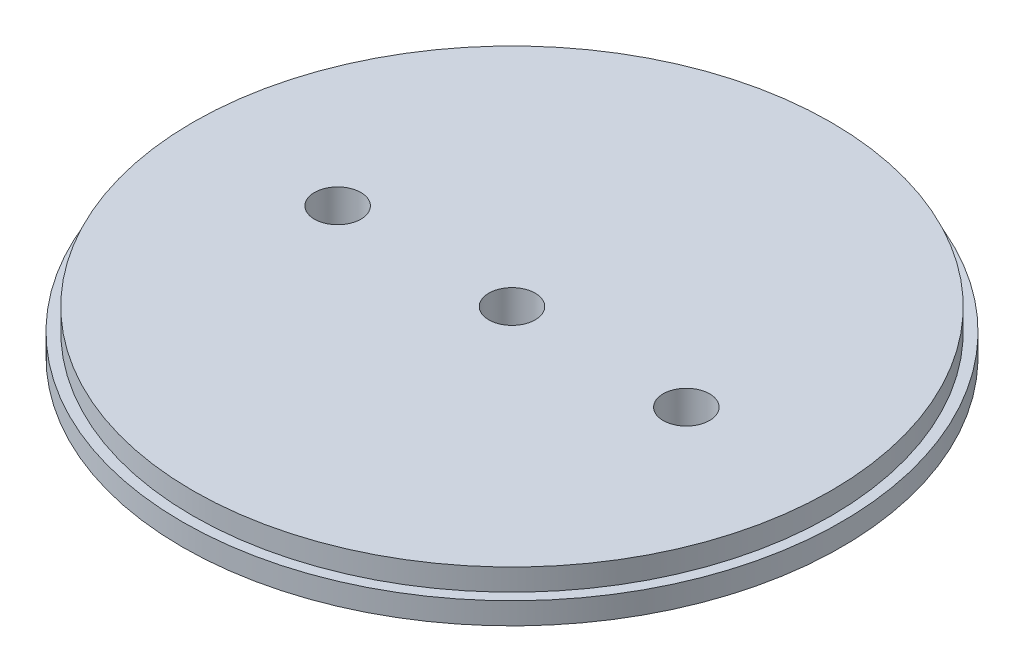
ISO-10303-21;
HEADER;
FILE_DESCRIPTION(('STEP AP214'),'2;1');
FILE_NAME('part.step','',(''),(''),'','','');
FILE_SCHEMA(('AUTOMOTIVE_DESIGN { 1 0 10303 214 1 1 1 1 }'));
ENDSEC;
DATA;
#1=APPLICATION_CONTEXT('core data for automotive mechanical design processes');
#2=APPLICATION_PROTOCOL_DEFINITION('international standard','automotive_design',2000,#1);
#3=PRODUCT_CONTEXT('',#1,'mechanical');
#4=PRODUCT('Part','Part','',(#3));
#5=PRODUCT_RELATED_PRODUCT_CATEGORY('part','',(#4));
#6=PRODUCT_DEFINITION_FORMATION('','',#4);
#7=PRODUCT_DEFINITION_CONTEXT('part definition',#1,'design');
#8=PRODUCT_DEFINITION('design','',#6,#7);
#9=PRODUCT_DEFINITION_SHAPE('','',#8);
#10=(LENGTH_UNIT() NAMED_UNIT(*) SI_UNIT(.MILLI.,.METRE.));
#11=(NAMED_UNIT(*) PLANE_ANGLE_UNIT() SI_UNIT($,.RADIAN.));
#12=(NAMED_UNIT(*) SI_UNIT($,.STERADIAN.) SOLID_ANGLE_UNIT());
#13=UNCERTAINTY_MEASURE_WITH_UNIT(LENGTH_MEASURE(1.E-05),#10,'distance_accuracy_value','');
#14=(GEOMETRIC_REPRESENTATION_CONTEXT(3) GLOBAL_UNCERTAINTY_ASSIGNED_CONTEXT((#13)) GLOBAL_UNIT_ASSIGNED_CONTEXT((#10,
#11,#12)) REPRESENTATION_CONTEXT('',''));
#15=CARTESIAN_POINT('',(0.,0.,0.));
#16=DIRECTION('',(0.,0.,1.));
#17=DIRECTION('',(1.,0.,0.));
#18=AXIS2_PLACEMENT_3D('',#15,#16,#17);
#19=CARTESIAN_POINT('',(0.,3.175,0.));
#20=DIRECTION('',(0.,-1.,0.));
#21=DIRECTION('',(0.,0.,-1.));
#22=AXIS2_PLACEMENT_3D('',#19,#20,#21);
#23=CYLINDRICAL_SURFACE('',#22,48.006);
#24=CARTESIAN_POINT('',(0.,3.175,0.));
#25=DIRECTION('',(0.,1.,0.));
#26=DIRECTION('',(0.,0.,1.));
#27=AXIS2_PLACEMENT_3D('',#24,#25,#26);
#28=CIRCLE('',#27,48.006);
#29=CARTESIAN_POINT('',(0.,3.175,48.006));
#30=VERTEX_POINT('',#29);
#31=EDGE_CURVE('E51',#30,#30,#28,.T.);
#32=ORIENTED_EDGE('',*,*,#31,.F.);
#33=EDGE_LOOP('',(#32));
#34=FACE_BOUND('',#33,.T.);
#35=CARTESIAN_POINT('',(0.,0.,0.));
#36=DIRECTION('',(0.,1.,0.));
#37=DIRECTION('',(0.,0.,1.));
#38=AXIS2_PLACEMENT_3D('',#35,#36,#37);
#39=CIRCLE('',#38,48.006);
#40=CARTESIAN_POINT('',(0.,0.,48.006));
#41=VERTEX_POINT('',#40);
#42=EDGE_CURVE('E57',#41,#41,#39,.T.);
#43=ORIENTED_EDGE('',*,*,#42,.T.);
#44=EDGE_LOOP('',(#43));
#45=FACE_BOUND('',#44,.T.);
#46=ADVANCED_FACE('F43',(#34,#45),#23,.T.);
#47=CARTESIAN_POINT('',(0.,3.175,0.));
#48=DIRECTION('',(0.,1.,0.));
#49=DIRECTION('',(0.,0.,1.));
#50=AXIS2_PLACEMENT_3D('',#47,#48,#49);
#51=PLANE('',#50);
#52=CARTESIAN_POINT('',(0.,3.175,0.));
#53=DIRECTION('',(0.,1.,0.));
#54=DIRECTION('',(0.,0.,1.));
#55=AXIS2_PLACEMENT_3D('',#52,#53,#54);
#56=CIRCLE('',#55,46.482);
#57=CARTESIAN_POINT('',(0.,3.175,46.482));
#58=VERTEX_POINT('',#57);
#59=EDGE_CURVE('E10',#58,#58,#56,.T.);
#60=ORIENTED_EDGE('',*,*,#59,.F.);
#61=EDGE_LOOP('',(#60));
#62=FACE_BOUND('',#61,.T.);
#63=ORIENTED_EDGE('',*,*,#31,.T.);
#64=EDGE_LOOP('',(#63));
#65=FACE_BOUND('',#64,.T.);
#66=ADVANCED_FACE('F103',(#62,#65),#51,.T.);
#67=CARTESIAN_POINT('',(0.,0.,0.));
#68=DIRECTION('',(0.,1.,0.));
#69=DIRECTION('',(0.,0.,1.));
#70=AXIS2_PLACEMENT_3D('',#67,#68,#69);
#71=PLANE('',#70);
#72=CARTESIAN_POINT('',(25.4,0.,0.));
#73=DIRECTION('',(0.,-1.,0.));
#74=DIRECTION('',(0.,0.,-1.));
#75=AXIS2_PLACEMENT_3D('',#72,#73,#74);
#76=CIRCLE('',#75,3.37819999999999);
#77=CARTESIAN_POINT('',(25.4,0.,-3.37819999999998));
#78=VERTEX_POINT('',#77);
#79=EDGE_CURVE('E92',#78,#78,#76,.T.);
#80=ORIENTED_EDGE('',*,*,#79,.F.);
#81=EDGE_LOOP('',(#80));
#82=FACE_BOUND('',#81,.T.);
#83=CARTESIAN_POINT('',(0.,0.,0.));
#84=DIRECTION('',(0.,-1.,0.));
#85=DIRECTION('',(0.,0.,-1.));
#86=AXIS2_PLACEMENT_3D('',#83,#84,#85);
#87=CIRCLE('',#86,3.37819999999999);
#88=CARTESIAN_POINT('',(0.,0.,-3.37819999999999));
#89=VERTEX_POINT('',#88);
#90=EDGE_CURVE('E82',#89,#89,#87,.T.);
#91=ORIENTED_EDGE('',*,*,#90,.F.);
#92=EDGE_LOOP('',(#91));
#93=FACE_BOUND('',#92,.T.);
#94=CARTESIAN_POINT('',(-25.4,0.,0.));
#95=DIRECTION('',(0.,-1.,0.));
#96=DIRECTION('',(0.,0.,-1.));
#97=AXIS2_PLACEMENT_3D('',#94,#95,#96);
#98=CIRCLE('',#97,3.37819999999999);
#99=CARTESIAN_POINT('',(-25.4,0.,-3.37819999999999));
#100=VERTEX_POINT('',#99);
#101=EDGE_CURVE('E72',#100,#100,#98,.T.);
#102=ORIENTED_EDGE('',*,*,#101,.F.);
#103=EDGE_LOOP('',(#102));
#104=FACE_BOUND('',#103,.T.);
#105=ORIENTED_EDGE('',*,*,#42,.F.);
#106=EDGE_LOOP('',(#105));
#107=FACE_BOUND('',#106,.T.);
#108=ADVANCED_FACE('F99',(#82,#93,#104,#107),#71,.F.);
#109=CARTESIAN_POINT('',(0.,6.35,0.));
#110=DIRECTION('',(0.,-1.,0.));
#111=DIRECTION('',(0.,0.,-1.));
#112=AXIS2_PLACEMENT_3D('',#109,#110,#111);
#113=CYLINDRICAL_SURFACE('',#112,46.482);
#114=CARTESIAN_POINT('',(0.,6.35,0.));
#115=DIRECTION('',(0.,1.,0.));
#116=DIRECTION('',(0.,0.,1.));
#117=AXIS2_PLACEMENT_3D('',#114,#115,#116);
#118=CIRCLE('',#117,46.482);
#119=CARTESIAN_POINT('',(0.,6.35,46.482));
#120=VERTEX_POINT('',#119);
#121=EDGE_CURVE('E60',#120,#120,#118,.T.);
#122=ORIENTED_EDGE('',*,*,#121,.F.);
#123=EDGE_LOOP('',(#122));
#124=FACE_BOUND('',#123,.T.);
#125=ORIENTED_EDGE('',*,*,#59,.T.);
#126=EDGE_LOOP('',(#125));
#127=FACE_BOUND('',#126,.T.);
#128=ADVANCED_FACE('F102',(#124,#127),#113,.T.);
#129=CARTESIAN_POINT('',(0.,6.35,0.));
#130=DIRECTION('',(0.,1.,0.));
#131=DIRECTION('',(0.,0.,1.));
#132=AXIS2_PLACEMENT_3D('',#129,#130,#131);
#133=PLANE('',#132);
#134=CARTESIAN_POINT('',(25.4,6.35,0.));
#135=DIRECTION('',(0.,1.,0.));
#136=DIRECTION('',(0.,0.,1.));
#137=AXIS2_PLACEMENT_3D('',#134,#135,#136);
#138=CIRCLE('',#137,3.37819999999999);
#139=CARTESIAN_POINT('',(25.4,6.35,3.3782));
#140=VERTEX_POINT('',#139);
#141=EDGE_CURVE('E88',#140,#140,#138,.T.);
#142=ORIENTED_EDGE('',*,*,#141,.F.);
#143=EDGE_LOOP('',(#142));
#144=FACE_BOUND('',#143,.T.);
#145=CARTESIAN_POINT('',(0.,6.35,0.));
#146=DIRECTION('',(0.,1.,0.));
#147=DIRECTION('',(0.,0.,1.));
#148=AXIS2_PLACEMENT_3D('',#145,#146,#147);
#149=CIRCLE('',#148,3.37819999999999);
#150=CARTESIAN_POINT('',(0.,6.35,3.37819999999999));
#151=VERTEX_POINT('',#150);
#152=EDGE_CURVE('E77',#151,#151,#149,.T.);
#153=ORIENTED_EDGE('',*,*,#152,.F.);
#154=EDGE_LOOP('',(#153));
#155=FACE_BOUND('',#154,.T.);
#156=CARTESIAN_POINT('',(-25.4,6.35,0.));
#157=DIRECTION('',(0.,1.,0.));
#158=DIRECTION('',(0.,0.,1.));
#159=AXIS2_PLACEMENT_3D('',#156,#157,#158);
#160=CIRCLE('',#159,3.37819999999999);
#161=CARTESIAN_POINT('',(-25.4,6.35,3.37819999999999));
#162=VERTEX_POINT('',#161);
#163=EDGE_CURVE('E46',#162,#162,#160,.T.);
#164=ORIENTED_EDGE('',*,*,#163,.F.);
#165=EDGE_LOOP('',(#164));
#166=FACE_BOUND('',#165,.T.);
#167=ORIENTED_EDGE('',*,*,#121,.T.);
#168=EDGE_LOOP('',(#167));
#169=FACE_BOUND('',#168,.T.);
#170=ADVANCED_FACE('F119',(#144,#155,#166,#169),#133,.T.);
#171=CARTESIAN_POINT('',(-25.4,0.,0.));
#172=DIRECTION('',(0.,-1.,0.));
#173=DIRECTION('',(0.,0.,-1.));
#174=AXIS2_PLACEMENT_3D('',#171,#172,#173);
#175=CYLINDRICAL_SURFACE('',#174,3.37819999999999);
#176=ORIENTED_EDGE('',*,*,#163,.T.);
#177=EDGE_LOOP('',(#176));
#178=FACE_BOUND('',#177,.T.);
#179=ORIENTED_EDGE('',*,*,#101,.T.);
#180=EDGE_LOOP('',(#179));
#181=FACE_BOUND('',#180,.T.);
#182=ADVANCED_FACE('F110',(#178,#181),#175,.F.);
#183=CARTESIAN_POINT('',(0.,0.,0.));
#184=DIRECTION('',(0.,-1.,0.));
#185=DIRECTION('',(0.,0.,-1.));
#186=AXIS2_PLACEMENT_3D('',#183,#184,#185);
#187=CYLINDRICAL_SURFACE('',#186,3.37819999999999);
#188=ORIENTED_EDGE('',*,*,#152,.T.);
#189=EDGE_LOOP('',(#188));
#190=FACE_BOUND('',#189,.T.);
#191=ORIENTED_EDGE('',*,*,#90,.T.);
#192=EDGE_LOOP('',(#191));
#193=FACE_BOUND('',#192,.T.);
#194=ADVANCED_FACE('F108',(#190,#193),#187,.F.);
#195=CARTESIAN_POINT('',(25.4,0.,0.));
#196=DIRECTION('',(0.,-1.,0.));
#197=DIRECTION('',(0.,0.,-1.));
#198=AXIS2_PLACEMENT_3D('',#195,#196,#197);
#199=CYLINDRICAL_SURFACE('',#198,3.37819999999999);
#200=ORIENTED_EDGE('',*,*,#141,.T.);
#201=EDGE_LOOP('',(#200));
#202=FACE_BOUND('',#201,.T.);
#203=ORIENTED_EDGE('',*,*,#79,.T.);
#204=EDGE_LOOP('',(#203));
#205=FACE_BOUND('',#204,.T.);
#206=ADVANCED_FACE('F97',(#202,#205),#199,.F.);
#207=CLOSED_SHELL('',(#46,#66,#108,#128,#170,#182,#194,#206));
#208=MANIFOLD_SOLID_BREP('B2',#207);
#209=ADVANCED_BREP_SHAPE_REPRESENTATION('',(#18,#208),#14);
#210=SHAPE_DEFINITION_REPRESENTATION(#9,#209);
ENDSEC;
END-ISO-10303-21;
